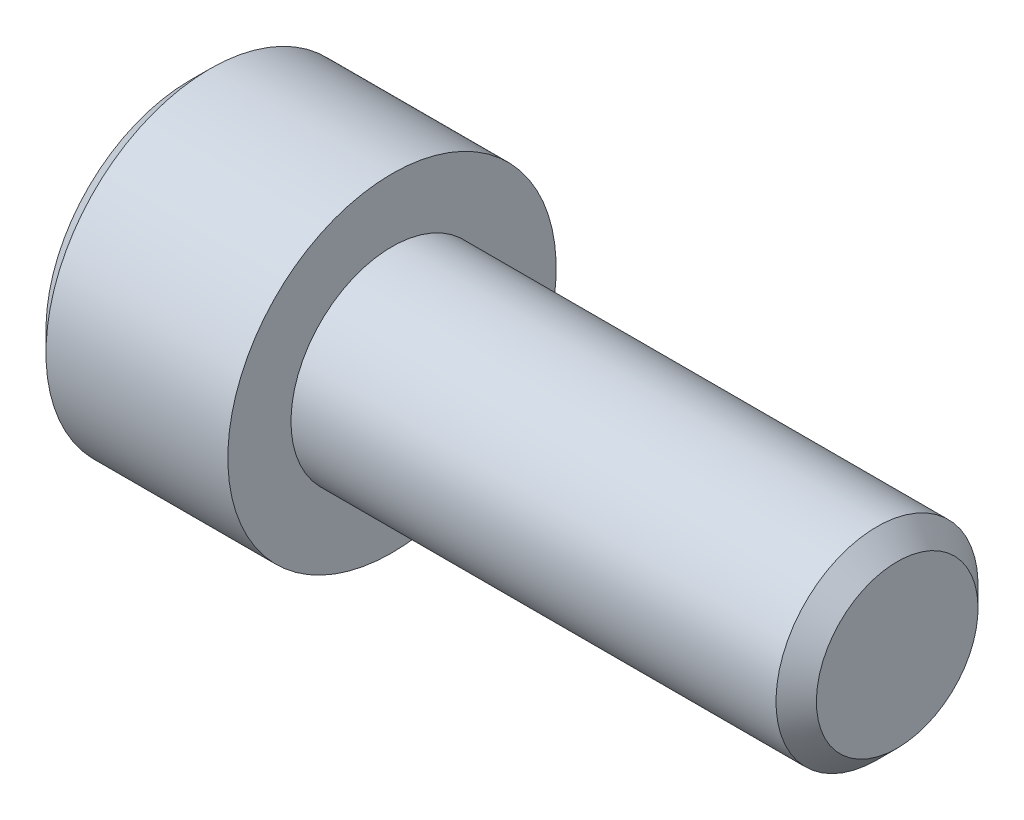
ISO-10303-21;
HEADER;
FILE_DESCRIPTION(('STEP AP214'),'2;1');
FILE_NAME('part.step','',(''),(''),'','','');
FILE_SCHEMA(('AUTOMOTIVE_DESIGN { 1 0 10303 214 1 1 1 1 }'));
ENDSEC;
DATA;
#1=APPLICATION_CONTEXT('core data for automotive mechanical design processes');
#2=APPLICATION_PROTOCOL_DEFINITION('international standard','automotive_design',2000,#1);
#3=PRODUCT_CONTEXT('',#1,'mechanical');
#4=PRODUCT('Part','Part','',(#3));
#5=PRODUCT_RELATED_PRODUCT_CATEGORY('part','',(#4));
#6=PRODUCT_DEFINITION_FORMATION('','',#4);
#7=PRODUCT_DEFINITION_CONTEXT('part definition',#1,'design');
#8=PRODUCT_DEFINITION('design','',#6,#7);
#9=PRODUCT_DEFINITION_SHAPE('','',#8);
#10=(LENGTH_UNIT() NAMED_UNIT(*) SI_UNIT(.MILLI.,.METRE.));
#11=(NAMED_UNIT(*) PLANE_ANGLE_UNIT() SI_UNIT($,.RADIAN.));
#12=(NAMED_UNIT(*) SI_UNIT($,.STERADIAN.) SOLID_ANGLE_UNIT());
#13=UNCERTAINTY_MEASURE_WITH_UNIT(LENGTH_MEASURE(1.E-05),#10,'distance_accuracy_value','');
#14=(GEOMETRIC_REPRESENTATION_CONTEXT(3) GLOBAL_UNCERTAINTY_ASSIGNED_CONTEXT((#13)) GLOBAL_UNIT_ASSIGNED_CONTEXT((#10,
#11,#12)) REPRESENTATION_CONTEXT('',''));
#15=CARTESIAN_POINT('',(0.,0.,0.));
#16=DIRECTION('',(0.,0.,1.));
#17=DIRECTION('',(1.,0.,0.));
#18=AXIS2_PLACEMENT_3D('',#15,#16,#17);
#19=CARTESIAN_POINT('',(-8.,0.,0.));
#20=DIRECTION('',(1.,0.,0.));
#21=DIRECTION('',(0.,1.,0.));
#22=AXIS2_PLACEMENT_3D('',#19,#20,#21);
#23=PLANE('',#22);
#24=CARTESIAN_POINT('',(-8.,0.,0.));
#25=DIRECTION('',(1.,0.,0.));
#26=DIRECTION('',(0.,1.,0.));
#27=AXIS2_PLACEMENT_3D('',#24,#25,#26);
#28=CIRCLE('',#27,5.69999999999999);
#29=CARTESIAN_POINT('',(-8.,5.69999999999999,0.));
#30=VERTEX_POINT('',#29);
#31=EDGE_CURVE('E153',#30,#30,#28,.F.);
#32=ORIENTED_EDGE('',*,*,#31,.T.);
#33=EDGE_LOOP('',(#32));
#34=FACE_BOUND('',#33,.T.);
#35=DIRECTION('',(0.,-0.500000000000005,-0.866025403784436));
#36=VECTOR('',#35,1.);
#37=CARTESIAN_POINT('',(-8.,-1.7320508075689,3.));
#38=LINE('',#37,#36);
#39=CARTESIAN_POINT('',(-8.,-1.7320508075689,3.));
#40=VERTEX_POINT('',#39);
#41=CARTESIAN_POINT('',(-8.,-3.4641016151378,0.));
#42=VERTEX_POINT('',#41);
#43=EDGE_CURVE('E272',#40,#42,#38,.T.);
#44=ORIENTED_EDGE('',*,*,#43,.T.);
#45=DIRECTION('',(0.,0.500000000000005,-0.866025403784436));
#46=VECTOR('',#45,1.);
#47=CARTESIAN_POINT('',(-8.,-3.4641016151378,0.));
#48=LINE('',#47,#46);
#49=CARTESIAN_POINT('',(-8.,-1.7320508075689,-3.));
#50=VERTEX_POINT('',#49);
#51=EDGE_CURVE('E274',#42,#50,#48,.T.);
#52=ORIENTED_EDGE('',*,*,#51,.T.);
#53=DIRECTION('',(0.,1.,0.));
#54=VECTOR('',#53,1.);
#55=CARTESIAN_POINT('',(-8.,-1.7320508075689,-3.));
#56=LINE('',#55,#54);
#57=CARTESIAN_POINT('',(-8.,1.7320508075689,-3.));
#58=VERTEX_POINT('',#57);
#59=EDGE_CURVE('E276',#50,#58,#56,.T.);
#60=ORIENTED_EDGE('',*,*,#59,.T.);
#61=DIRECTION('',(0.,0.500000000000005,0.866025403784436));
#62=VECTOR('',#61,1.);
#63=CARTESIAN_POINT('',(-8.,1.7320508075689,-3.));
#64=LINE('',#63,#62);
#65=CARTESIAN_POINT('',(-8.,3.4641016151378,0.));
#66=VERTEX_POINT('',#65);
#67=EDGE_CURVE('E121',#58,#66,#64,.T.);
#68=ORIENTED_EDGE('',*,*,#67,.T.);
#69=DIRECTION('',(0.,-0.500000000000005,0.866025403784436));
#70=VECTOR('',#69,1.);
#71=CARTESIAN_POINT('',(-8.,3.4641016151378,0.));
#72=LINE('',#71,#70);
#73=CARTESIAN_POINT('',(-8.,1.7320508075689,3.));
#74=VERTEX_POINT('',#73);
#75=EDGE_CURVE('E269',#66,#74,#72,.T.);
#76=ORIENTED_EDGE('',*,*,#75,.T.);
#77=DIRECTION('',(0.,-1.,0.));
#78=VECTOR('',#77,1.);
#79=CARTESIAN_POINT('',(-8.,1.7320508075689,3.));
#80=LINE('',#79,#78);
#81=EDGE_CURVE('E136',#74,#40,#80,.T.);
#82=ORIENTED_EDGE('',*,*,#81,.T.);
#83=EDGE_LOOP('',(#44,#52,#60,#68,#76,#82));
#84=FACE_BOUND('',#83,.T.);
#85=ADVANCED_FACE('F37',(#34,#84),#23,.F.);
#86=CARTESIAN_POINT('',(20.,0.,0.));
#87=DIRECTION('',(-1.,0.,0.));
#88=DIRECTION('',(0.,-1.,0.));
#89=AXIS2_PLACEMENT_3D('',#86,#87,#88);
#90=CYLINDRICAL_SURFACE('',#89,6.5);
#91=CARTESIAN_POINT('',(-7.19999999999999,0.,0.));
#92=DIRECTION('',(1.,0.,0.));
#93=DIRECTION('',(0.,1.,0.));
#94=AXIS2_PLACEMENT_3D('',#91,#92,#93);
#95=CIRCLE('',#94,6.5);
#96=CARTESIAN_POINT('',(-7.19999999999999,6.5,0.));
#97=VERTEX_POINT('',#96);
#98=EDGE_CURVE('E156',#97,#97,#95,.T.);
#99=ORIENTED_EDGE('',*,*,#98,.T.);
#100=EDGE_LOOP('',(#99));
#101=FACE_BOUND('',#100,.T.);
#102=CARTESIAN_POINT('',(0.,0.,0.));
#103=DIRECTION('',(-1.,0.,0.));
#104=DIRECTION('',(0.,-1.,0.));
#105=AXIS2_PLACEMENT_3D('',#102,#103,#104);
#106=CIRCLE('',#105,6.5);
#107=CARTESIAN_POINT('',(0.,-6.5,0.));
#108=VERTEX_POINT('',#107);
#109=EDGE_CURVE('E150',#108,#108,#106,.T.);
#110=ORIENTED_EDGE('',*,*,#109,.T.);
#111=EDGE_LOOP('',(#110));
#112=FACE_BOUND('',#111,.T.);
#113=ADVANCED_FACE('F176',(#101,#112),#90,.T.);
#114=CARTESIAN_POINT('',(0.,6.5,0.));
#115=DIRECTION('',(-1.,0.,0.));
#116=DIRECTION('',(0.,-1.,0.));
#117=AXIS2_PLACEMENT_3D('',#114,#115,#116);
#118=PLANE('',#117);
#119=ORIENTED_EDGE('',*,*,#109,.F.);
#120=EDGE_LOOP('',(#119));
#121=FACE_BOUND('',#120,.T.);
#122=CARTESIAN_POINT('',(0.,0.,0.));
#123=DIRECTION('',(-1.,0.,0.));
#124=DIRECTION('',(0.,-1.,0.));
#125=AXIS2_PLACEMENT_3D('',#122,#123,#124);
#126=CIRCLE('',#125,4.);
#127=CARTESIAN_POINT('',(0.,-4.,0.));
#128=VERTEX_POINT('',#127);
#129=EDGE_CURVE('E146',#128,#128,#126,.T.);
#130=ORIENTED_EDGE('',*,*,#129,.T.);
#131=EDGE_LOOP('',(#130));
#132=FACE_BOUND('',#131,.T.);
#133=ADVANCED_FACE('F182',(#121,#132),#118,.F.);
#134=CARTESIAN_POINT('',(20.,0.,0.));
#135=DIRECTION('',(-1.,0.,0.));
#136=DIRECTION('',(0.,-1.,0.));
#137=AXIS2_PLACEMENT_3D('',#134,#135,#136);
#138=CYLINDRICAL_SURFACE('',#137,4.);
#139=CARTESIAN_POINT('',(19.2,0.,0.));
#140=DIRECTION('',(-1.,0.,0.));
#141=DIRECTION('',(0.,-1.,0.));
#142=AXIS2_PLACEMENT_3D('',#139,#140,#141);
#143=CIRCLE('',#142,4.);
#144=CARTESIAN_POINT('',(19.2,-4.,0.));
#145=VERTEX_POINT('',#144);
#146=EDGE_CURVE('E45',#145,#145,#143,.T.);
#147=ORIENTED_EDGE('',*,*,#146,.T.);
#148=EDGE_LOOP('',(#147));
#149=FACE_BOUND('',#148,.T.);
#150=ORIENTED_EDGE('',*,*,#129,.F.);
#151=EDGE_LOOP('',(#150));
#152=FACE_BOUND('',#151,.T.);
#153=ADVANCED_FACE('F161',(#149,#152),#138,.T.);
#154=CARTESIAN_POINT('',(20.,4.,0.));
#155=DIRECTION('',(-1.,0.,0.));
#156=DIRECTION('',(0.,-1.,0.));
#157=AXIS2_PLACEMENT_3D('',#154,#155,#156);
#158=PLANE('',#157);
#159=CARTESIAN_POINT('',(20.,0.,0.));
#160=DIRECTION('',(-1.,0.,0.));
#161=DIRECTION('',(0.,-1.,0.));
#162=AXIS2_PLACEMENT_3D('',#159,#160,#161);
#163=CIRCLE('',#162,3.2);
#164=CARTESIAN_POINT('',(20.,-3.2,0.));
#165=VERTEX_POINT('',#164);
#166=EDGE_CURVE('E11',#165,#165,#163,.F.);
#167=ORIENTED_EDGE('',*,*,#166,.T.);
#168=EDGE_LOOP('',(#167));
#169=FACE_BOUND('',#168,.T.);
#170=ADVANCED_FACE('F173',(#169),#158,.F.);
#171=CARTESIAN_POINT('',(-8.,0.,0.));
#172=DIRECTION('',(1.,0.,0.));
#173=DIRECTION('',(0.,1.,0.));
#174=AXIS2_PLACEMENT_3D('',#171,#172,#173);
#175=CONICAL_SURFACE('',#174,5.69999999999999,0.785398163397445);
#176=ORIENTED_EDGE('',*,*,#98,.F.);
#177=EDGE_LOOP('',(#176));
#178=FACE_BOUND('',#177,.T.);
#179=ORIENTED_EDGE('',*,*,#31,.F.);
#180=EDGE_LOOP('',(#179));
#181=FACE_BOUND('',#180,.T.);
#182=ADVANCED_FACE('F165',(#178,#181),#175,.T.);
#183=CARTESIAN_POINT('',(19.2,0.,0.));
#184=DIRECTION('',(-1.,0.,0.));
#185=DIRECTION('',(0.,-1.,0.));
#186=AXIS2_PLACEMENT_3D('',#183,#184,#185);
#187=CONICAL_SURFACE('',#186,4.,0.785398163397452);
#188=ORIENTED_EDGE('',*,*,#166,.F.);
#189=EDGE_LOOP('',(#188));
#190=FACE_BOUND('',#189,.T.);
#191=ORIENTED_EDGE('',*,*,#146,.F.);
#192=EDGE_LOOP('',(#191));
#193=FACE_BOUND('',#192,.T.);
#194=ADVANCED_FACE('F39',(#190,#193),#187,.T.);
#195=CARTESIAN_POINT('',(-4.,3.4641016151378,0.));
#196=DIRECTION('',(0.,-0.866025403784436,-0.500000000000005));
#197=DIRECTION('',(0.,0.500000000000005,-0.866025403784436));
#198=AXIS2_PLACEMENT_3D('',#195,#196,#197);
#199=PLANE('',#198);
#200=DIRECTION('',(0.,-0.500000000000005,0.866025403784436));
#201=VECTOR('',#200,1.);
#202=CARTESIAN_POINT('',(-4.,3.4641016151378,0.));
#203=LINE('',#202,#201);
#204=CARTESIAN_POINT('',(-4.,3.4641016151378,0.));
#205=VERTEX_POINT('',#204);
#206=CARTESIAN_POINT('',(-4.,2.59807621135333,1.50000000000003));
#207=VERTEX_POINT('',#206);
#208=EDGE_CURVE('E118',#205,#207,#203,.T.);
#209=ORIENTED_EDGE('',*,*,#208,.T.);
#210=CARTESIAN_POINT('',(-4.,1.7320508075689,3.));
#211=VERTEX_POINT('',#210);
#212=EDGE_CURVE('E110',#207,#211,#203,.T.);
#213=ORIENTED_EDGE('',*,*,#212,.T.);
#214=DIRECTION('',(-1.,0.,0.));
#215=VECTOR('',#214,1.);
#216=CARTESIAN_POINT('',(-4.,1.7320508075689,3.));
#217=LINE('',#216,#215);
#218=EDGE_CURVE('E115',#211,#74,#217,.T.);
#219=ORIENTED_EDGE('',*,*,#218,.T.);
#220=ORIENTED_EDGE('',*,*,#75,.F.);
#221=DIRECTION('',(-1.,0.,0.));
#222=VECTOR('',#221,1.);
#223=CARTESIAN_POINT('',(-4.,3.4641016151378,0.));
#224=LINE('',#223,#222);
#225=EDGE_CURVE('E253',#205,#66,#224,.T.);
#226=ORIENTED_EDGE('',*,*,#225,.F.);
#227=EDGE_LOOP('',(#209,#213,#219,#220,#226));
#228=FACE_BOUND('',#227,.T.);
#229=ADVANCED_FACE('F112',(#228),#199,.T.);
#230=CARTESIAN_POINT('',(-4.,1.7320508075689,3.));
#231=DIRECTION('',(0.,0.,-1.));
#232=DIRECTION('',(-1.,0.,0.));
#233=AXIS2_PLACEMENT_3D('',#230,#231,#232);
#234=PLANE('',#233);
#235=DIRECTION('',(0.,-1.,0.));
#236=VECTOR('',#235,1.);
#237=CARTESIAN_POINT('',(-4.,1.7320508075689,3.));
#238=LINE('',#237,#236);
#239=CARTESIAN_POINT('',(-4.,0.,3.));
#240=VERTEX_POINT('',#239);
#241=EDGE_CURVE('E124',#211,#240,#238,.T.);
#242=ORIENTED_EDGE('',*,*,#241,.T.);
#243=CARTESIAN_POINT('',(-4.,-1.7320508075689,3.));
#244=VERTEX_POINT('',#243);
#245=EDGE_CURVE('E131',#240,#244,#238,.T.);
#246=ORIENTED_EDGE('',*,*,#245,.T.);
#247=DIRECTION('',(-1.,0.,0.));
#248=VECTOR('',#247,1.);
#249=CARTESIAN_POINT('',(-4.,-1.7320508075689,3.));
#250=LINE('',#249,#248);
#251=EDGE_CURVE('E138',#244,#40,#250,.T.);
#252=ORIENTED_EDGE('',*,*,#251,.T.);
#253=ORIENTED_EDGE('',*,*,#81,.F.);
#254=ORIENTED_EDGE('',*,*,#218,.F.);
#255=EDGE_LOOP('',(#242,#246,#252,#253,#254));
#256=FACE_BOUND('',#255,.T.);
#257=ADVANCED_FACE('F134',(#256),#234,.T.);
#258=CARTESIAN_POINT('',(-4.,-1.7320508075689,3.));
#259=DIRECTION('',(0.,0.866025403784436,-0.500000000000005));
#260=DIRECTION('',(0.,0.500000000000005,0.866025403784436));
#261=AXIS2_PLACEMENT_3D('',#258,#259,#260);
#262=PLANE('',#261);
#263=DIRECTION('',(0.,-0.500000000000005,-0.866025403784436));
#264=VECTOR('',#263,1.);
#265=CARTESIAN_POINT('',(-4.,-1.7320508075689,3.));
#266=LINE('',#265,#264);
#267=CARTESIAN_POINT('',(-4.,-2.59807621135333,1.50000000000003));
#268=VERTEX_POINT('',#267);
#269=EDGE_CURVE('E260',#244,#268,#266,.T.);
#270=ORIENTED_EDGE('',*,*,#269,.T.);
#271=CARTESIAN_POINT('',(-4.,-3.4641016151378,0.));
#272=VERTEX_POINT('',#271);
#273=EDGE_CURVE('E130',#268,#272,#266,.T.);
#274=ORIENTED_EDGE('',*,*,#273,.T.);
#275=DIRECTION('',(-1.,0.,0.));
#276=VECTOR('',#275,1.);
#277=CARTESIAN_POINT('',(-4.,-3.4641016151378,0.));
#278=LINE('',#277,#276);
#279=EDGE_CURVE('E142',#272,#42,#278,.T.);
#280=ORIENTED_EDGE('',*,*,#279,.T.);
#281=ORIENTED_EDGE('',*,*,#43,.F.);
#282=ORIENTED_EDGE('',*,*,#251,.F.);
#283=EDGE_LOOP('',(#270,#274,#280,#281,#282));
#284=FACE_BOUND('',#283,.T.);
#285=ADVANCED_FACE('F202',(#284),#262,.T.);
#286=CARTESIAN_POINT('',(-4.,-3.4641016151378,0.));
#287=DIRECTION('',(0.,0.866025403784436,0.500000000000005));
#288=DIRECTION('',(0.,-0.500000000000005,0.866025403784436));
#289=AXIS2_PLACEMENT_3D('',#286,#287,#288);
#290=PLANE('',#289);
#291=DIRECTION('',(0.,0.500000000000005,-0.866025403784436));
#292=VECTOR('',#291,1.);
#293=CARTESIAN_POINT('',(-4.,-3.4641016151378,0.));
#294=LINE('',#293,#292);
#295=CARTESIAN_POINT('',(-4.,-2.59807621135331,-1.50000000000001));
#296=VERTEX_POINT('',#295);
#297=EDGE_CURVE('E52',#272,#296,#294,.T.);
#298=ORIENTED_EDGE('',*,*,#297,.T.);
#299=CARTESIAN_POINT('',(-4.,-1.7320508075689,-3.));
#300=VERTEX_POINT('',#299);
#301=EDGE_CURVE('E265',#296,#300,#294,.T.);
#302=ORIENTED_EDGE('',*,*,#301,.T.);
#303=DIRECTION('',(-1.,0.,0.));
#304=VECTOR('',#303,1.);
#305=CARTESIAN_POINT('',(-4.,-1.7320508075689,-3.));
#306=LINE('',#305,#304);
#307=EDGE_CURVE('E281',#300,#50,#306,.T.);
#308=ORIENTED_EDGE('',*,*,#307,.T.);
#309=ORIENTED_EDGE('',*,*,#51,.F.);
#310=ORIENTED_EDGE('',*,*,#279,.F.);
#311=EDGE_LOOP('',(#298,#302,#308,#309,#310));
#312=FACE_BOUND('',#311,.T.);
#313=ADVANCED_FACE('F205',(#312),#290,.T.);
#314=CARTESIAN_POINT('',(-4.,-1.7320508075689,-3.));
#315=DIRECTION('',(0.,0.,1.));
#316=DIRECTION('',(1.,0.,0.));
#317=AXIS2_PLACEMENT_3D('',#314,#315,#316);
#318=PLANE('',#317);
#319=DIRECTION('',(0.,1.,0.));
#320=VECTOR('',#319,1.);
#321=CARTESIAN_POINT('',(-4.,-1.7320508075689,-3.));
#322=LINE('',#321,#320);
#323=CARTESIAN_POINT('',(-4.,0.,-3.));
#324=VERTEX_POINT('',#323);
#325=EDGE_CURVE('E247',#300,#324,#322,.T.);
#326=ORIENTED_EDGE('',*,*,#325,.T.);
#327=CARTESIAN_POINT('',(-4.,1.7320508075689,-3.));
#328=VERTEX_POINT('',#327);
#329=EDGE_CURVE('E240',#324,#328,#322,.T.);
#330=ORIENTED_EDGE('',*,*,#329,.T.);
#331=DIRECTION('',(-1.,0.,0.));
#332=VECTOR('',#331,1.);
#333=CARTESIAN_POINT('',(-4.,1.7320508075689,-3.));
#334=LINE('',#333,#332);
#335=EDGE_CURVE('E252',#328,#58,#334,.T.);
#336=ORIENTED_EDGE('',*,*,#335,.T.);
#337=ORIENTED_EDGE('',*,*,#59,.F.);
#338=ORIENTED_EDGE('',*,*,#307,.F.);
#339=EDGE_LOOP('',(#326,#330,#336,#337,#338));
#340=FACE_BOUND('',#339,.T.);
#341=ADVANCED_FACE('F209',(#340),#318,.T.);
#342=CARTESIAN_POINT('',(-4.,1.7320508075689,-3.));
#343=DIRECTION('',(0.,-0.866025403784436,0.500000000000005));
#344=DIRECTION('',(0.,-0.500000000000005,-0.866025403784436));
#345=AXIS2_PLACEMENT_3D('',#342,#343,#344);
#346=PLANE('',#345);
#347=DIRECTION('',(0.,0.500000000000005,0.866025403784436));
#348=VECTOR('',#347,1.);
#349=CARTESIAN_POINT('',(-4.,1.7320508075689,-3.));
#350=LINE('',#349,#348);
#351=CARTESIAN_POINT('',(-4.,2.59807621135333,-1.50000000000003));
#352=VERTEX_POINT('',#351);
#353=EDGE_CURVE('E239',#328,#352,#350,.T.);
#354=ORIENTED_EDGE('',*,*,#353,.T.);
#355=EDGE_CURVE('E245',#352,#205,#350,.T.);
#356=ORIENTED_EDGE('',*,*,#355,.T.);
#357=ORIENTED_EDGE('',*,*,#225,.T.);
#358=ORIENTED_EDGE('',*,*,#67,.F.);
#359=ORIENTED_EDGE('',*,*,#335,.F.);
#360=EDGE_LOOP('',(#354,#356,#357,#358,#359));
#361=FACE_BOUND('',#360,.T.);
#362=ADVANCED_FACE('F212',(#361),#346,.T.);
#363=CARTESIAN_POINT('',(-4.,1.7320508075689,3.));
#364=DIRECTION('',(1.,0.,0.));
#365=DIRECTION('',(0.,0.,-1.));
#366=AXIS2_PLACEMENT_3D('',#363,#364,#365);
#367=PLANE('',#366);
#368=CARTESIAN_POINT('',(-4.,0.,0.));
#369=DIRECTION('',(-1.,0.,0.));
#370=DIRECTION('',(0.,0.,1.));
#371=AXIS2_PLACEMENT_3D('',#368,#369,#370);
#372=CIRCLE('',#371,3.);
#373=EDGE_CURVE('E236',#352,#324,#372,.T.);
#374=ORIENTED_EDGE('',*,*,#373,.F.);
#375=ORIENTED_EDGE('',*,*,#353,.F.);
#376=ORIENTED_EDGE('',*,*,#329,.F.);
#377=EDGE_LOOP('',(#374,#375,#376));
#378=FACE_BOUND('',#377,.T.);
#379=ADVANCED_FACE('F216',(#378),#367,.F.);
#380=EDGE_CURVE('E147',#207,#352,#372,.T.);
#381=ORIENTED_EDGE('',*,*,#380,.F.);
#382=ORIENTED_EDGE('',*,*,#208,.F.);
#383=ORIENTED_EDGE('',*,*,#355,.F.);
#384=EDGE_LOOP('',(#381,#382,#383));
#385=FACE_BOUND('',#384,.T.);
#386=ADVANCED_FACE('F227',(#385),#367,.F.);
#387=EDGE_CURVE('E126',#240,#207,#372,.T.);
#388=ORIENTED_EDGE('',*,*,#387,.F.);
#389=ORIENTED_EDGE('',*,*,#241,.F.);
#390=ORIENTED_EDGE('',*,*,#212,.F.);
#391=EDGE_LOOP('',(#388,#389,#390));
#392=FACE_BOUND('',#391,.T.);
#393=ADVANCED_FACE('F125',(#392),#367,.F.);
#394=EDGE_CURVE('E137',#268,#240,#372,.T.);
#395=ORIENTED_EDGE('',*,*,#394,.F.);
#396=ORIENTED_EDGE('',*,*,#269,.F.);
#397=ORIENTED_EDGE('',*,*,#245,.F.);
#398=EDGE_LOOP('',(#395,#396,#397));
#399=FACE_BOUND('',#398,.T.);
#400=ADVANCED_FACE('F224',(#399),#367,.F.);
#401=EDGE_CURVE('E140',#296,#268,#372,.T.);
#402=ORIENTED_EDGE('',*,*,#401,.F.);
#403=ORIENTED_EDGE('',*,*,#297,.F.);
#404=ORIENTED_EDGE('',*,*,#273,.F.);
#405=EDGE_LOOP('',(#402,#403,#404));
#406=FACE_BOUND('',#405,.T.);
#407=ADVANCED_FACE('F219',(#406),#367,.F.);
#408=EDGE_CURVE('E244',#324,#296,#372,.T.);
#409=ORIENTED_EDGE('',*,*,#408,.F.);
#410=ORIENTED_EDGE('',*,*,#325,.F.);
#411=ORIENTED_EDGE('',*,*,#301,.F.);
#412=EDGE_LOOP('',(#409,#410,#411));
#413=FACE_BOUND('',#412,.T.);
#414=ADVANCED_FACE('F197',(#413),#367,.F.);
#415=CARTESIAN_POINT('',(-3.1961524227066,0.,0.));
#416=DIRECTION('',(-1.,0.,0.));
#417=DIRECTION('',(0.,0.,1.));
#418=AXIS2_PLACEMENT_3D('',#415,#416,#417);
#419=CONICAL_SURFACE('',#418,0.,1.30899693899574);
#420=ORIENTED_EDGE('',*,*,#387,.T.);
#421=ORIENTED_EDGE('',*,*,#380,.T.);
#422=ORIENTED_EDGE('',*,*,#373,.T.);
#423=ORIENTED_EDGE('',*,*,#408,.T.);
#424=ORIENTED_EDGE('',*,*,#401,.T.);
#425=ORIENTED_EDGE('',*,*,#394,.T.);
#426=EDGE_LOOP('',(#420,#421,#422,#423,#424,#425));
#427=FACE_BOUND('',#426,.T.);
#428=CARTESIAN_POINT('',(-3.1961524227066,0.,0.));
#429=VERTEX_POINT('',#428);
#430=VERTEX_LOOP('',#429);
#431=FACE_BOUND('',#430,.T.);
#432=ADVANCED_FACE('F195',(#427,#431),#419,.F.);
#433=CLOSED_SHELL('',(#85,#113,#133,#153,#170,#182,#194,#229,#257,#285,#313,#341,#362,#379,#386,
#393,#400,#407,#414,#432));
#434=MANIFOLD_SOLID_BREP('B2',#433);
#435=ADVANCED_BREP_SHAPE_REPRESENTATION('',(#18,#434),#14);
#436=SHAPE_DEFINITION_REPRESENTATION(#9,#435);
ENDSEC;
END-ISO-10303-21;
